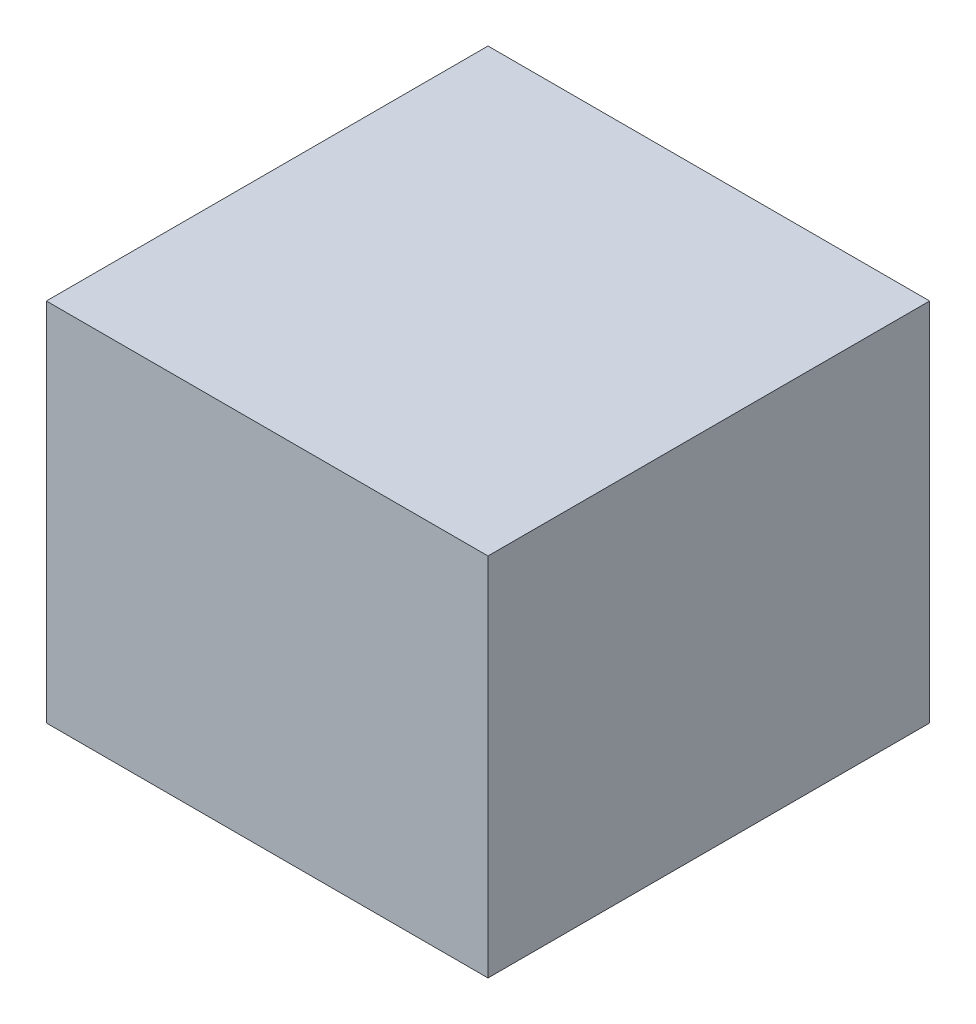
ISO-10303-21;
HEADER;
FILE_DESCRIPTION(('STEP AP214'),'2;1');
FILE_NAME('part.step','',(''),(''),'','','');
FILE_SCHEMA(('AUTOMOTIVE_DESIGN { 1 0 10303 214 1 1 1 1 }'));
ENDSEC;
DATA;
#1=APPLICATION_CONTEXT('core data for automotive mechanical design processes');
#2=APPLICATION_PROTOCOL_DEFINITION('international standard','automotive_design',2000,#1);
#3=PRODUCT_CONTEXT('',#1,'mechanical');
#4=PRODUCT('Part','Part','',(#3));
#5=PRODUCT_RELATED_PRODUCT_CATEGORY('part','',(#4));
#6=PRODUCT_DEFINITION_FORMATION('','',#4);
#7=PRODUCT_DEFINITION_CONTEXT('part definition',#1,'design');
#8=PRODUCT_DEFINITION('design','',#6,#7);
#9=PRODUCT_DEFINITION_SHAPE('','',#8);
#10=(LENGTH_UNIT() NAMED_UNIT(*) SI_UNIT(.MILLI.,.METRE.));
#11=(NAMED_UNIT(*) PLANE_ANGLE_UNIT() SI_UNIT($,.RADIAN.));
#12=(NAMED_UNIT(*) SI_UNIT($,.STERADIAN.) SOLID_ANGLE_UNIT());
#13=UNCERTAINTY_MEASURE_WITH_UNIT(LENGTH_MEASURE(1.E-05),#10,'distance_accuracy_value','');
#14=(GEOMETRIC_REPRESENTATION_CONTEXT(3) GLOBAL_UNCERTAINTY_ASSIGNED_CONTEXT((#13)) GLOBAL_UNIT_ASSIGNED_CONTEXT((#10,
#11,#12)) REPRESENTATION_CONTEXT('',''));
#15=CARTESIAN_POINT('',(0.,0.,0.));
#16=DIRECTION('',(0.,0.,1.));
#17=DIRECTION('',(1.,0.,0.));
#18=AXIS2_PLACEMENT_3D('',#15,#16,#17);
#19=CARTESIAN_POINT('',(-0.72499982,-0.5999988,0.));
#20=DIRECTION('',(0.,1.,0.));
#21=DIRECTION('',(0.,0.,1.));
#22=AXIS2_PLACEMENT_3D('',#19,#20,#21);
#23=PLANE('',#22);
#24=DIRECTION('',(0.,0.,1.));
#25=VECTOR('',#24,1.);
#26=CARTESIAN_POINT('',(0.72499982,-0.5999988,0.));
#27=LINE('',#26,#25);
#28=CARTESIAN_POINT('',(0.72499982,-0.5999988,0.));
#29=VERTEX_POINT('',#28);
#30=CARTESIAN_POINT('',(0.72499982,-0.5999988,1.44999964));
#31=VERTEX_POINT('',#30);
#32=EDGE_CURVE('E20',#29,#31,#27,.T.);
#33=ORIENTED_EDGE('',*,*,#32,.T.);
#34=DIRECTION('',(-1.,0.,0.));
#35=VECTOR('',#34,1.);
#36=CARTESIAN_POINT('',(0.72499982,-0.5999988,1.44999964));
#37=LINE('',#36,#35);
#38=CARTESIAN_POINT('',(-0.72499982,-0.5999988,1.44999964));
#39=VERTEX_POINT('',#38);
#40=EDGE_CURVE('E55',#31,#39,#37,.T.);
#41=ORIENTED_EDGE('',*,*,#40,.T.);
#42=DIRECTION('',(0.,0.,-1.));
#43=VECTOR('',#42,1.);
#44=CARTESIAN_POINT('',(-0.72499982,-0.5999988,0.));
#45=LINE('',#44,#43);
#46=CARTESIAN_POINT('',(-0.72499982,-0.5999988,0.));
#47=VERTEX_POINT('',#46);
#48=EDGE_CURVE('E76',#39,#47,#45,.T.);
#49=ORIENTED_EDGE('',*,*,#48,.T.);
#50=DIRECTION('',(-1.,0.,0.));
#51=VECTOR('',#50,1.);
#52=CARTESIAN_POINT('',(0.72499982,-0.5999988,0.));
#53=LINE('',#52,#51);
#54=EDGE_CURVE('E58',#29,#47,#53,.T.);
#55=ORIENTED_EDGE('',*,*,#54,.F.);
#56=EDGE_LOOP('',(#33,#41,#49,#55));
#57=FACE_BOUND('',#56,.T.);
#58=ADVANCED_FACE('F17',(#57),#23,.F.);
#59=CARTESIAN_POINT('',(0.72499982,-0.5999988,0.));
#60=DIRECTION('',(-1.,0.,0.));
#61=DIRECTION('',(0.,0.,1.));
#62=AXIS2_PLACEMENT_3D('',#59,#60,#61);
#63=PLANE('',#62);
#64=DIRECTION('',(0.,0.,-1.));
#65=VECTOR('',#64,1.);
#66=CARTESIAN_POINT('',(0.72499982,0.60000134,0.));
#67=LINE('',#66,#65);
#68=CARTESIAN_POINT('',(0.72499982,0.60000134,0.));
#69=VERTEX_POINT('',#68);
#70=CARTESIAN_POINT('',(0.72499982,0.60000134,1.44999964));
#71=VERTEX_POINT('',#70);
#72=EDGE_CURVE('E73',#69,#71,#67,.F.);
#73=ORIENTED_EDGE('',*,*,#72,.T.);
#74=DIRECTION('',(0.,1.,0.));
#75=VECTOR('',#74,1.);
#76=CARTESIAN_POINT('',(0.72499982,0.60000134,1.44999964));
#77=LINE('',#76,#75);
#78=EDGE_CURVE('E63',#71,#31,#77,.F.);
#79=ORIENTED_EDGE('',*,*,#78,.T.);
#80=ORIENTED_EDGE('',*,*,#32,.F.);
#81=DIRECTION('',(0.,1.,0.));
#82=VECTOR('',#81,1.);
#83=CARTESIAN_POINT('',(0.72499982,0.60000134,0.));
#84=LINE('',#83,#82);
#85=EDGE_CURVE('E78',#69,#29,#84,.F.);
#86=ORIENTED_EDGE('',*,*,#85,.F.);
#87=EDGE_LOOP('',(#73,#79,#80,#86));
#88=FACE_BOUND('',#87,.T.);
#89=ADVANCED_FACE('F72',(#88),#63,.F.);
#90=CARTESIAN_POINT('',(0.72499982,0.60000134,1.44999964));
#91=DIRECTION('',(0.,0.,-1.));
#92=DIRECTION('',(-1.,0.,0.));
#93=AXIS2_PLACEMENT_3D('',#90,#91,#92);
#94=PLANE('',#93);
#95=DIRECTION('',(0.,1.,0.));
#96=VECTOR('',#95,1.);
#97=CARTESIAN_POINT('',(-0.72499982,0.60000134,1.44999964));
#98=LINE('',#97,#96);
#99=CARTESIAN_POINT('',(-0.72499982,0.60000134,1.44999964));
#100=VERTEX_POINT('',#99);
#101=EDGE_CURVE('E69',#100,#39,#98,.F.);
#102=ORIENTED_EDGE('',*,*,#101,.T.);
#103=ORIENTED_EDGE('',*,*,#40,.F.);
#104=ORIENTED_EDGE('',*,*,#78,.F.);
#105=DIRECTION('',(1.,0.,0.));
#106=VECTOR('',#105,1.);
#107=CARTESIAN_POINT('',(0.72499982,0.60000134,1.44999964));
#108=LINE('',#107,#106);
#109=EDGE_CURVE('E83',#71,#100,#108,.F.);
#110=ORIENTED_EDGE('',*,*,#109,.T.);
#111=EDGE_LOOP('',(#102,#103,#104,#110));
#112=FACE_BOUND('',#111,.T.);
#113=ADVANCED_FACE('F66',(#112),#94,.F.);
#114=CARTESIAN_POINT('',(-0.72499982,0.60000134,0.));
#115=DIRECTION('',(1.,0.,0.));
#116=DIRECTION('',(0.,0.,-1.));
#117=AXIS2_PLACEMENT_3D('',#114,#115,#116);
#118=PLANE('',#117);
#119=ORIENTED_EDGE('',*,*,#48,.F.);
#120=ORIENTED_EDGE('',*,*,#101,.F.);
#121=DIRECTION('',(0.,0.,-1.));
#122=VECTOR('',#121,1.);
#123=CARTESIAN_POINT('',(-0.72499982,0.60000134,0.));
#124=LINE('',#123,#122);
#125=CARTESIAN_POINT('',(-0.72499982,0.60000134,0.));
#126=VERTEX_POINT('',#125);
#127=EDGE_CURVE('E26',#100,#126,#124,.T.);
#128=ORIENTED_EDGE('',*,*,#127,.T.);
#129=DIRECTION('',(0.,1.,0.));
#130=VECTOR('',#129,1.);
#131=CARTESIAN_POINT('',(-0.72499982,0.60000134,0.));
#132=LINE('',#131,#130);
#133=EDGE_CURVE('E34',#47,#126,#132,.T.);
#134=ORIENTED_EDGE('',*,*,#133,.F.);
#135=EDGE_LOOP('',(#119,#120,#128,#134));
#136=FACE_BOUND('',#135,.T.);
#137=ADVANCED_FACE('F88',(#136),#118,.F.);
#138=CARTESIAN_POINT('',(0.72499982,0.60000134,0.));
#139=DIRECTION('',(0.,0.,-1.));
#140=DIRECTION('',(-1.,0.,0.));
#141=AXIS2_PLACEMENT_3D('',#138,#139,#140);
#142=PLANE('',#141);
#143=ORIENTED_EDGE('',*,*,#133,.T.);
#144=DIRECTION('',(1.,0.,0.));
#145=VECTOR('',#144,1.);
#146=CARTESIAN_POINT('',(0.72499982,0.60000134,0.));
#147=LINE('',#146,#145);
#148=EDGE_CURVE('E11',#126,#69,#147,.T.);
#149=ORIENTED_EDGE('',*,*,#148,.T.);
#150=ORIENTED_EDGE('',*,*,#85,.T.);
#151=ORIENTED_EDGE('',*,*,#54,.T.);
#152=EDGE_LOOP('',(#143,#149,#150,#151));
#153=FACE_BOUND('',#152,.T.);
#154=ADVANCED_FACE('F91',(#153),#142,.T.);
#155=CARTESIAN_POINT('',(0.72499982,0.60000134,0.));
#156=DIRECTION('',(0.,-1.,0.));
#157=DIRECTION('',(0.,0.,-1.));
#158=AXIS2_PLACEMENT_3D('',#155,#156,#157);
#159=PLANE('',#158);
#160=ORIENTED_EDGE('',*,*,#127,.F.);
#161=ORIENTED_EDGE('',*,*,#109,.F.);
#162=ORIENTED_EDGE('',*,*,#72,.F.);
#163=ORIENTED_EDGE('',*,*,#148,.F.);
#164=EDGE_LOOP('',(#160,#161,#162,#163));
#165=FACE_BOUND('',#164,.T.);
#166=ADVANCED_FACE('F90',(#165),#159,.F.);
#167=CLOSED_SHELL('',(#58,#89,#113,#137,#154,#166));
#168=MANIFOLD_SOLID_BREP('B1',#167);
#169=ADVANCED_BREP_SHAPE_REPRESENTATION('',(#18,#168),#14);
#170=SHAPE_DEFINITION_REPRESENTATION(#9,#169);
ENDSEC;
END-ISO-10303-21;
